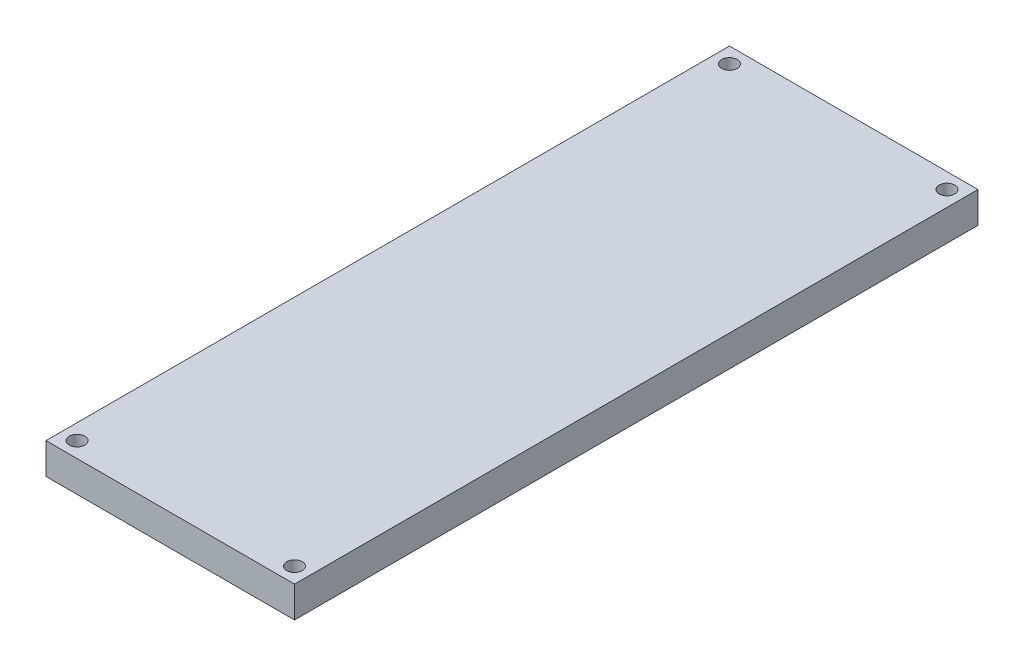
ISO-10303-21;
HEADER;
FILE_DESCRIPTION(('STEP AP214'),'2;1');
FILE_NAME('part.step','',(''),(''),'','','');
FILE_SCHEMA(('AUTOMOTIVE_DESIGN { 1 0 10303 214 1 1 1 1 }'));
ENDSEC;
DATA;
#1=APPLICATION_CONTEXT('core data for automotive mechanical design processes');
#2=APPLICATION_PROTOCOL_DEFINITION('international standard','automotive_design',2000,#1);
#3=PRODUCT_CONTEXT('',#1,'mechanical');
#4=PRODUCT('Part','Part','',(#3));
#5=PRODUCT_RELATED_PRODUCT_CATEGORY('part','',(#4));
#6=PRODUCT_DEFINITION_FORMATION('','',#4);
#7=PRODUCT_DEFINITION_CONTEXT('part definition',#1,'design');
#8=PRODUCT_DEFINITION('design','',#6,#7);
#9=PRODUCT_DEFINITION_SHAPE('','',#8);
#10=(LENGTH_UNIT() NAMED_UNIT(*) SI_UNIT(.MILLI.,.METRE.));
#11=(NAMED_UNIT(*) PLANE_ANGLE_UNIT() SI_UNIT($,.RADIAN.));
#12=(NAMED_UNIT(*) SI_UNIT($,.STERADIAN.) SOLID_ANGLE_UNIT());
#13=UNCERTAINTY_MEASURE_WITH_UNIT(LENGTH_MEASURE(1.E-05),#10,'distance_accuracy_value','');
#14=(GEOMETRIC_REPRESENTATION_CONTEXT(3) GLOBAL_UNCERTAINTY_ASSIGNED_CONTEXT((#13)) GLOBAL_UNIT_ASSIGNED_CONTEXT((#10,
#11,#12)) REPRESENTATION_CONTEXT('',''));
#15=CARTESIAN_POINT('',(0.,0.,0.));
#16=DIRECTION('',(0.,0.,1.));
#17=DIRECTION('',(1.,0.,0.));
#18=AXIS2_PLACEMENT_3D('',#15,#16,#17);
#19=CARTESIAN_POINT('',(0.,12.7,0.));
#20=DIRECTION('',(0.,1.,0.));
#21=DIRECTION('',(0.,0.,1.));
#22=AXIS2_PLACEMENT_3D('',#19,#20,#21);
#23=PLANE('',#22);
#24=CARTESIAN_POINT('',(44.4500000000001,12.7,133.35));
#25=DIRECTION('',(0.,1.,0.));
#26=DIRECTION('',(0.,0.,1.));
#27=AXIS2_PLACEMENT_3D('',#24,#25,#26);
#28=CIRCLE('',#27,3.175);
#29=CARTESIAN_POINT('',(44.4500000000001,12.7,136.525));
#30=VERTEX_POINT('',#29);
#31=EDGE_CURVE('E133',#30,#30,#28,.F.);
#32=ORIENTED_EDGE('',*,*,#31,.T.);
#33=EDGE_LOOP('',(#32));
#34=FACE_BOUND('',#33,.T.);
#35=CARTESIAN_POINT('',(-44.45,12.7,133.35));
#36=DIRECTION('',(0.,1.,0.));
#37=DIRECTION('',(0.,0.,1.));
#38=AXIS2_PLACEMENT_3D('',#35,#36,#37);
#39=CIRCLE('',#38,3.175);
#40=CARTESIAN_POINT('',(-44.45,12.7,136.525));
#41=VERTEX_POINT('',#40);
#42=EDGE_CURVE('E115',#41,#41,#39,.T.);
#43=ORIENTED_EDGE('',*,*,#42,.F.);
#44=EDGE_LOOP('',(#43));
#45=FACE_BOUND('',#44,.T.);
#46=DIRECTION('',(0.,0.,-1.));
#47=VECTOR('',#46,1.);
#48=CARTESIAN_POINT('',(50.8000000000001,12.7,139.7));
#49=LINE('',#48,#47);
#50=CARTESIAN_POINT('',(50.8000000000001,12.7,139.7));
#51=VERTEX_POINT('',#50);
#52=CARTESIAN_POINT('',(50.8000000000001,12.7,-139.7));
#53=VERTEX_POINT('',#52);
#54=EDGE_CURVE('E88',#51,#53,#49,.T.);
#55=ORIENTED_EDGE('',*,*,#54,.T.);
#56=DIRECTION('',(-1.,0.,0.));
#57=VECTOR('',#56,1.);
#58=CARTESIAN_POINT('',(50.8000000000001,12.7,-139.7));
#59=LINE('',#58,#57);
#60=CARTESIAN_POINT('',(-50.8,12.7,-139.7));
#61=VERTEX_POINT('',#60);
#62=EDGE_CURVE('E83',#53,#61,#59,.T.);
#63=ORIENTED_EDGE('',*,*,#62,.T.);
#64=DIRECTION('',(0.,0.,1.));
#65=VECTOR('',#64,1.);
#66=CARTESIAN_POINT('',(-50.8,12.7,139.7));
#67=LINE('',#66,#65);
#68=CARTESIAN_POINT('',(-50.8,12.7,139.7));
#69=VERTEX_POINT('',#68);
#70=EDGE_CURVE('E86',#61,#69,#67,.T.);
#71=ORIENTED_EDGE('',*,*,#70,.T.);
#72=DIRECTION('',(1.,0.,0.));
#73=VECTOR('',#72,1.);
#74=CARTESIAN_POINT('',(50.8000000000001,12.7,139.7));
#75=LINE('',#74,#73);
#76=EDGE_CURVE('E53',#69,#51,#75,.T.);
#77=ORIENTED_EDGE('',*,*,#76,.T.);
#78=EDGE_LOOP('',(#55,#63,#71,#77));
#79=FACE_BOUND('',#78,.T.);
#80=CARTESIAN_POINT('',(44.45,12.7,-133.35));
#81=DIRECTION('',(0.,1.,0.));
#82=DIRECTION('',(0.,0.,1.));
#83=AXIS2_PLACEMENT_3D('',#80,#81,#82);
#84=CIRCLE('',#83,3.175);
#85=CARTESIAN_POINT('',(44.45,12.7,-130.175));
#86=VERTEX_POINT('',#85);
#87=EDGE_CURVE('E127',#86,#86,#84,.T.);
#88=ORIENTED_EDGE('',*,*,#87,.F.);
#89=EDGE_LOOP('',(#88));
#90=FACE_BOUND('',#89,.T.);
#91=CARTESIAN_POINT('',(-44.45,12.7,-133.35));
#92=DIRECTION('',(0.,1.,0.));
#93=DIRECTION('',(0.,0.,1.));
#94=AXIS2_PLACEMENT_3D('',#91,#92,#93);
#95=CIRCLE('',#94,3.175);
#96=CARTESIAN_POINT('',(-44.45,12.7,-130.175));
#97=VERTEX_POINT('',#96);
#98=EDGE_CURVE('E121',#97,#97,#95,.F.);
#99=ORIENTED_EDGE('',*,*,#98,.T.);
#100=EDGE_LOOP('',(#99));
#101=FACE_BOUND('',#100,.T.);
#102=ADVANCED_FACE('F36',(#34,#45,#79,#90,#101),#23,.T.);
#103=CARTESIAN_POINT('',(0.,0.,0.));
#104=DIRECTION('',(0.,1.,0.));
#105=DIRECTION('',(0.,0.,1.));
#106=AXIS2_PLACEMENT_3D('',#103,#104,#105);
#107=PLANE('',#106);
#108=CARTESIAN_POINT('',(44.45,0.,-133.35));
#109=DIRECTION('',(0.,1.,0.));
#110=DIRECTION('',(0.,0.,1.));
#111=AXIS2_PLACEMENT_3D('',#108,#109,#110);
#112=CIRCLE('',#111,3.175);
#113=CARTESIAN_POINT('',(44.45,0.,-130.175));
#114=VERTEX_POINT('',#113);
#115=EDGE_CURVE('E130',#114,#114,#112,.T.);
#116=ORIENTED_EDGE('',*,*,#115,.T.);
#117=EDGE_LOOP('',(#116));
#118=FACE_BOUND('',#117,.T.);
#119=CARTESIAN_POINT('',(-44.45,0.,133.35));
#120=DIRECTION('',(0.,1.,0.));
#121=DIRECTION('',(0.,0.,1.));
#122=AXIS2_PLACEMENT_3D('',#119,#120,#121);
#123=CIRCLE('',#122,3.175);
#124=CARTESIAN_POINT('',(-44.45,0.,136.525));
#125=VERTEX_POINT('',#124);
#126=EDGE_CURVE('E103',#125,#125,#123,.T.);
#127=ORIENTED_EDGE('',*,*,#126,.T.);
#128=EDGE_LOOP('',(#127));
#129=FACE_BOUND('',#128,.T.);
#130=DIRECTION('',(0.,0.,-1.));
#131=VECTOR('',#130,1.);
#132=CARTESIAN_POINT('',(50.8000000000001,0.,139.7));
#133=LINE('',#132,#131);
#134=CARTESIAN_POINT('',(50.8000000000001,0.,139.7));
#135=VERTEX_POINT('',#134);
#136=CARTESIAN_POINT('',(50.8000000000001,0.,-139.7));
#137=VERTEX_POINT('',#136);
#138=EDGE_CURVE('E100',#135,#137,#133,.T.);
#139=ORIENTED_EDGE('',*,*,#138,.F.);
#140=DIRECTION('',(1.,0.,0.));
#141=VECTOR('',#140,1.);
#142=CARTESIAN_POINT('',(50.8000000000001,0.,139.7));
#143=LINE('',#142,#141);
#144=CARTESIAN_POINT('',(-50.8,0.,139.7));
#145=VERTEX_POINT('',#144);
#146=EDGE_CURVE('E76',#145,#135,#143,.T.);
#147=ORIENTED_EDGE('',*,*,#146,.F.);
#148=DIRECTION('',(0.,0.,1.));
#149=VECTOR('',#148,1.);
#150=CARTESIAN_POINT('',(-50.8,0.,139.7));
#151=LINE('',#150,#149);
#152=CARTESIAN_POINT('',(-50.8,0.,-139.7));
#153=VERTEX_POINT('',#152);
#154=EDGE_CURVE('E70',#153,#145,#151,.T.);
#155=ORIENTED_EDGE('',*,*,#154,.F.);
#156=DIRECTION('',(-1.,0.,0.));
#157=VECTOR('',#156,1.);
#158=CARTESIAN_POINT('',(50.8000000000001,0.,-139.7));
#159=LINE('',#158,#157);
#160=EDGE_CURVE('E92',#137,#153,#159,.T.);
#161=ORIENTED_EDGE('',*,*,#160,.F.);
#162=EDGE_LOOP('',(#139,#147,#155,#161));
#163=FACE_BOUND('',#162,.T.);
#164=CARTESIAN_POINT('',(44.4500000000001,0.,133.35));
#165=DIRECTION('',(0.,1.,0.));
#166=DIRECTION('',(0.,0.,1.));
#167=AXIS2_PLACEMENT_3D('',#164,#165,#166);
#168=CIRCLE('',#167,3.175);
#169=CARTESIAN_POINT('',(44.4500000000001,0.,136.525));
#170=VERTEX_POINT('',#169);
#171=EDGE_CURVE('E118',#170,#170,#168,.F.);
#172=ORIENTED_EDGE('',*,*,#171,.F.);
#173=EDGE_LOOP('',(#172));
#174=FACE_BOUND('',#173,.T.);
#175=CARTESIAN_POINT('',(-44.45,0.,-133.35));
#176=DIRECTION('',(0.,1.,0.));
#177=DIRECTION('',(0.,0.,1.));
#178=AXIS2_PLACEMENT_3D('',#175,#176,#177);
#179=CIRCLE('',#178,3.175);
#180=CARTESIAN_POINT('',(-44.45,0.,-130.175));
#181=VERTEX_POINT('',#180);
#182=EDGE_CURVE('E124',#181,#181,#179,.F.);
#183=ORIENTED_EDGE('',*,*,#182,.F.);
#184=EDGE_LOOP('',(#183));
#185=FACE_BOUND('',#184,.T.);
#186=ADVANCED_FACE('F111',(#118,#129,#163,#174,#185),#107,.F.);
#187=CARTESIAN_POINT('',(50.8000000000001,12.7,139.7));
#188=DIRECTION('',(-1.,0.,0.));
#189=DIRECTION('',(0.,0.,1.));
#190=AXIS2_PLACEMENT_3D('',#187,#188,#189);
#191=PLANE('',#190);
#192=ORIENTED_EDGE('',*,*,#138,.T.);
#193=DIRECTION('',(0.,-1.,0.));
#194=VECTOR('',#193,1.);
#195=CARTESIAN_POINT('',(50.8000000000001,12.7,-139.7));
#196=LINE('',#195,#194);
#197=EDGE_CURVE('E11',#53,#137,#196,.T.);
#198=ORIENTED_EDGE('',*,*,#197,.F.);
#199=ORIENTED_EDGE('',*,*,#54,.F.);
#200=DIRECTION('',(0.,-1.,0.));
#201=VECTOR('',#200,1.);
#202=CARTESIAN_POINT('',(50.8000000000001,12.7,139.7));
#203=LINE('',#202,#201);
#204=EDGE_CURVE('E96',#51,#135,#203,.T.);
#205=ORIENTED_EDGE('',*,*,#204,.T.);
#206=EDGE_LOOP('',(#192,#198,#199,#205));
#207=FACE_BOUND('',#206,.T.);
#208=ADVANCED_FACE('F38',(#207),#191,.F.);
#209=CARTESIAN_POINT('',(50.8000000000001,12.7,-139.7));
#210=DIRECTION('',(0.,0.,1.));
#211=DIRECTION('',(1.,0.,0.));
#212=AXIS2_PLACEMENT_3D('',#209,#210,#211);
#213=PLANE('',#212);
#214=ORIENTED_EDGE('',*,*,#160,.T.);
#215=DIRECTION('',(0.,-1.,0.));
#216=VECTOR('',#215,1.);
#217=CARTESIAN_POINT('',(-50.8,12.7,-139.7));
#218=LINE('',#217,#216);
#219=EDGE_CURVE('E45',#61,#153,#218,.T.);
#220=ORIENTED_EDGE('',*,*,#219,.F.);
#221=ORIENTED_EDGE('',*,*,#62,.F.);
#222=ORIENTED_EDGE('',*,*,#197,.T.);
#223=EDGE_LOOP('',(#214,#220,#221,#222));
#224=FACE_BOUND('',#223,.T.);
#225=ADVANCED_FACE('F91',(#224),#213,.F.);
#226=CARTESIAN_POINT('',(-50.8,12.7,139.7));
#227=DIRECTION('',(1.,0.,0.));
#228=DIRECTION('',(0.,0.,-1.));
#229=AXIS2_PLACEMENT_3D('',#226,#227,#228);
#230=PLANE('',#229);
#231=ORIENTED_EDGE('',*,*,#154,.T.);
#232=DIRECTION('',(0.,-1.,0.));
#233=VECTOR('',#232,1.);
#234=CARTESIAN_POINT('',(-50.8,12.7,139.7));
#235=LINE('',#234,#233);
#236=EDGE_CURVE('E93',#69,#145,#235,.T.);
#237=ORIENTED_EDGE('',*,*,#236,.F.);
#238=ORIENTED_EDGE('',*,*,#70,.F.);
#239=ORIENTED_EDGE('',*,*,#219,.T.);
#240=EDGE_LOOP('',(#231,#237,#238,#239));
#241=FACE_BOUND('',#240,.T.);
#242=ADVANCED_FACE('F94',(#241),#230,.F.);
#243=CARTESIAN_POINT('',(50.8000000000001,12.7,139.7));
#244=DIRECTION('',(0.,0.,-1.));
#245=DIRECTION('',(-1.,0.,0.));
#246=AXIS2_PLACEMENT_3D('',#243,#244,#245);
#247=PLANE('',#246);
#248=ORIENTED_EDGE('',*,*,#146,.T.);
#249=ORIENTED_EDGE('',*,*,#204,.F.);
#250=ORIENTED_EDGE('',*,*,#76,.F.);
#251=ORIENTED_EDGE('',*,*,#236,.T.);
#252=EDGE_LOOP('',(#248,#249,#250,#251));
#253=FACE_BOUND('',#252,.T.);
#254=ADVANCED_FACE('F108',(#253),#247,.F.);
#255=CARTESIAN_POINT('',(-44.45,0.,133.35));
#256=DIRECTION('',(0.,1.,0.));
#257=DIRECTION('',(0.,0.,1.));
#258=AXIS2_PLACEMENT_3D('',#255,#256,#257);
#259=CYLINDRICAL_SURFACE('',#258,3.175);
#260=ORIENTED_EDGE('',*,*,#126,.F.);
#261=EDGE_LOOP('',(#260));
#262=FACE_BOUND('',#261,.T.);
#263=ORIENTED_EDGE('',*,*,#42,.T.);
#264=EDGE_LOOP('',(#263));
#265=FACE_BOUND('',#264,.T.);
#266=ADVANCED_FACE('F161',(#262,#265),#259,.F.);
#267=CARTESIAN_POINT('',(44.4500000000001,0.,133.35));
#268=DIRECTION('',(0.,1.,0.));
#269=DIRECTION('',(0.,0.,1.));
#270=AXIS2_PLACEMENT_3D('',#267,#268,#269);
#271=CYLINDRICAL_SURFACE('',#270,3.175);
#272=ORIENTED_EDGE('',*,*,#171,.T.);
#273=EDGE_LOOP('',(#272));
#274=FACE_BOUND('',#273,.T.);
#275=ORIENTED_EDGE('',*,*,#31,.F.);
#276=EDGE_LOOP('',(#275));
#277=FACE_BOUND('',#276,.T.);
#278=ADVANCED_FACE('F139',(#274,#277),#271,.F.);
#279=CARTESIAN_POINT('',(44.45,0.,-133.35));
#280=DIRECTION('',(0.,1.,0.));
#281=DIRECTION('',(0.,0.,1.));
#282=AXIS2_PLACEMENT_3D('',#279,#280,#281);
#283=CYLINDRICAL_SURFACE('',#282,3.175);
#284=ORIENTED_EDGE('',*,*,#115,.F.);
#285=EDGE_LOOP('',(#284));
#286=FACE_BOUND('',#285,.T.);
#287=ORIENTED_EDGE('',*,*,#87,.T.);
#288=EDGE_LOOP('',(#287));
#289=FACE_BOUND('',#288,.T.);
#290=ADVANCED_FACE('F150',(#286,#289),#283,.F.);
#291=CARTESIAN_POINT('',(-44.45,0.,-133.35));
#292=DIRECTION('',(0.,1.,0.));
#293=DIRECTION('',(0.,0.,1.));
#294=AXIS2_PLACEMENT_3D('',#291,#292,#293);
#295=CYLINDRICAL_SURFACE('',#294,3.175);
#296=ORIENTED_EDGE('',*,*,#182,.T.);
#297=EDGE_LOOP('',(#296));
#298=FACE_BOUND('',#297,.T.);
#299=ORIENTED_EDGE('',*,*,#98,.F.);
#300=EDGE_LOOP('',(#299));
#301=FACE_BOUND('',#300,.T.);
#302=ADVANCED_FACE('F147',(#298,#301),#295,.F.);
#303=CLOSED_SHELL('',(#102,#186,#208,#225,#242,#254,#266,#278,#290,#302));
#304=MANIFOLD_SOLID_BREP('B2',#303);
#305=ADVANCED_BREP_SHAPE_REPRESENTATION('',(#18,#304),#14);
#306=SHAPE_DEFINITION_REPRESENTATION(#9,#305);
ENDSEC;
END-ISO-10303-21;
